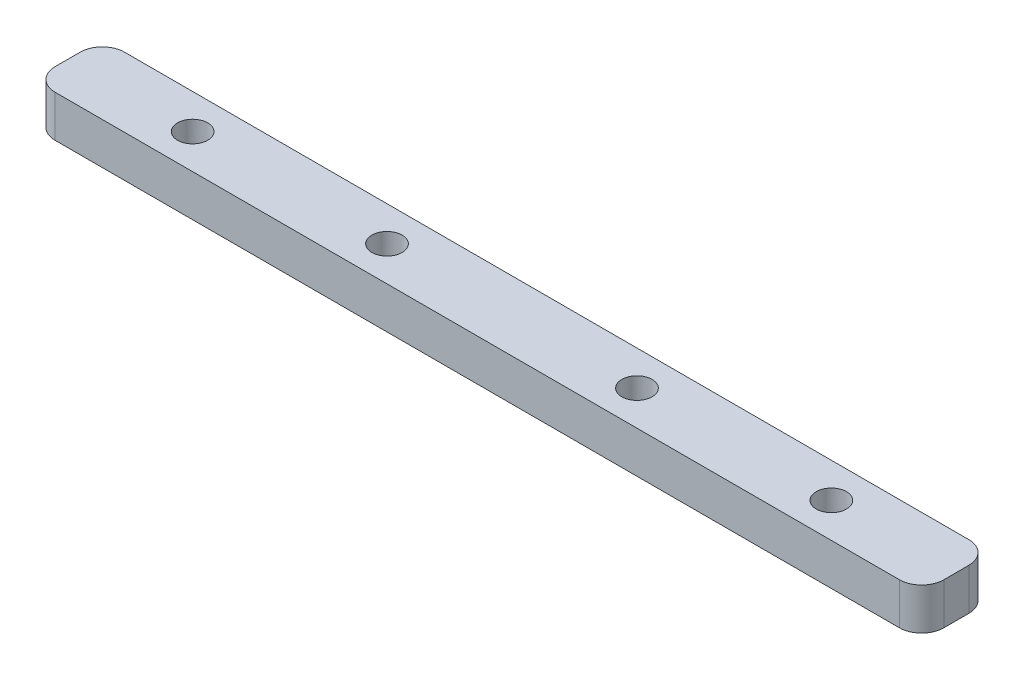
ISO-10303-21;
HEADER;
FILE_DESCRIPTION(('STEP AP214'),'2;1');
FILE_NAME('part.step','',(''),(''),'','','');
FILE_SCHEMA(('AUTOMOTIVE_DESIGN { 1 0 10303 214 1 1 1 1 }'));
ENDSEC;
DATA;
#1=APPLICATION_CONTEXT('core data for automotive mechanical design processes');
#2=APPLICATION_PROTOCOL_DEFINITION('international standard','automotive_design',2000,#1);
#3=PRODUCT_CONTEXT('',#1,'mechanical');
#4=PRODUCT('Part','Part','',(#3));
#5=PRODUCT_RELATED_PRODUCT_CATEGORY('part','',(#4));
#6=PRODUCT_DEFINITION_FORMATION('','',#4);
#7=PRODUCT_DEFINITION_CONTEXT('part definition',#1,'design');
#8=PRODUCT_DEFINITION('design','',#6,#7);
#9=PRODUCT_DEFINITION_SHAPE('','',#8);
#10=(LENGTH_UNIT() NAMED_UNIT(*) SI_UNIT(.MILLI.,.METRE.));
#11=(NAMED_UNIT(*) PLANE_ANGLE_UNIT() SI_UNIT($,.RADIAN.));
#12=(NAMED_UNIT(*) SI_UNIT($,.STERADIAN.) SOLID_ANGLE_UNIT());
#13=UNCERTAINTY_MEASURE_WITH_UNIT(LENGTH_MEASURE(1.E-05),#10,'distance_accuracy_value','');
#14=(GEOMETRIC_REPRESENTATION_CONTEXT(3) GLOBAL_UNCERTAINTY_ASSIGNED_CONTEXT((#13)) GLOBAL_UNIT_ASSIGNED_CONTEXT((#10,
#11,#12)) REPRESENTATION_CONTEXT('',''));
#15=CARTESIAN_POINT('',(0.,0.,0.));
#16=DIRECTION('',(0.,0.,1.));
#17=DIRECTION('',(1.,0.,0.));
#18=AXIS2_PLACEMENT_3D('',#15,#16,#17);
#19=CARTESIAN_POINT('',(-50.8,101.909586920221,39.1889208080387));
#20=DIRECTION('',(0.,0.,1.));
#21=DIRECTION('',(0.,-1.,0.));
#22=AXIS2_PLACEMENT_3D('',#19,#20,#21);
#23=PLANE('',#22);
#24=DIRECTION('',(-1.,0.,0.));
#25=VECTOR('',#24,1.);
#26=CARTESIAN_POINT('',(-50.8,-4.76250000012575,39.1889208080386));
#27=LINE('',#26,#25);
#28=CARTESIAN_POINT('',(48.26,-4.76250000012575,39.1889208080386));
#29=VERTEX_POINT('',#28);
#30=CARTESIAN_POINT('',(-48.26,-4.76250000012575,39.1889208080386));
#31=VERTEX_POINT('',#30);
#32=EDGE_CURVE('E133',#29,#31,#27,.T.);
#33=ORIENTED_EDGE('',*,*,#32,.T.);
#34=DIRECTION('',(0.,-1.,0.));
#35=VECTOR('',#34,1.);
#36=CARTESIAN_POINT('',(-48.26,101.909586920221,39.1889208080387));
#37=LINE('',#36,#35);
#38=CARTESIAN_POINT('',(-48.26,0.,39.1889208080386));
#39=VERTEX_POINT('',#38);
#40=EDGE_CURVE('E144',#31,#39,#37,.F.);
#41=ORIENTED_EDGE('',*,*,#40,.T.);
#42=DIRECTION('',(-1.,0.,0.));
#43=VECTOR('',#42,1.);
#44=CARTESIAN_POINT('',(-50.8,0.,39.1889208080386));
#45=LINE('',#44,#43);
#46=CARTESIAN_POINT('',(48.26,0.,39.1889208080386));
#47=VERTEX_POINT('',#46);
#48=EDGE_CURVE('E109',#47,#39,#45,.T.);
#49=ORIENTED_EDGE('',*,*,#48,.F.);
#50=DIRECTION('',(0.,-1.,0.));
#51=VECTOR('',#50,1.);
#52=CARTESIAN_POINT('',(48.26,101.909586920221,39.1889208080387));
#53=LINE('',#52,#51);
#54=EDGE_CURVE('E141',#47,#29,#53,.T.);
#55=ORIENTED_EDGE('',*,*,#54,.T.);
#56=EDGE_LOOP('',(#33,#41,#49,#55));
#57=FACE_BOUND('',#56,.T.);
#58=ADVANCED_FACE('F37',(#57),#23,.F.);
#59=CARTESIAN_POINT('',(50.8,101.909586920221,39.1889208080387));
#60=DIRECTION('',(-1.,0.,0.));
#61=DIRECTION('',(0.,0.707106781186548,0.707106781186547));
#62=AXIS2_PLACEMENT_3D('',#59,#60,#61);
#63=PLANE('',#62);
#64=DIRECTION('',(0.,0.,-1.));
#65=VECTOR('',#64,1.);
#66=CARTESIAN_POINT('',(50.8,-4.76250000012575,39.1889208080386));
#67=LINE('',#66,#65);
#68=CARTESIAN_POINT('',(50.8,-4.76250000012575,44.5864208080386));
#69=VERTEX_POINT('',#68);
#70=CARTESIAN_POINT('',(50.8,-4.76250000012575,41.7289208080386));
#71=VERTEX_POINT('',#70);
#72=EDGE_CURVE('E157',#69,#71,#67,.T.);
#73=ORIENTED_EDGE('',*,*,#72,.T.);
#74=DIRECTION('',(0.,-1.,0.));
#75=VECTOR('',#74,1.);
#76=CARTESIAN_POINT('',(50.8,101.909586920221,41.7289208080387));
#77=LINE('',#76,#75);
#78=CARTESIAN_POINT('',(50.8,0.,41.7289208080386));
#79=VERTEX_POINT('',#78);
#80=EDGE_CURVE('E11',#71,#79,#77,.F.);
#81=ORIENTED_EDGE('',*,*,#80,.T.);
#82=DIRECTION('',(0.,0.,-1.));
#83=VECTOR('',#82,1.);
#84=CARTESIAN_POINT('',(50.8,0.,39.1889208080387));
#85=LINE('',#84,#83);
#86=CARTESIAN_POINT('',(50.8,0.,44.5864208080386));
#87=VERTEX_POINT('',#86);
#88=EDGE_CURVE('E158',#87,#79,#85,.T.);
#89=ORIENTED_EDGE('',*,*,#88,.F.);
#90=DIRECTION('',(0.,-1.,0.));
#91=VECTOR('',#90,1.);
#92=CARTESIAN_POINT('',(50.8,101.909586920221,44.5864208080387));
#93=LINE('',#92,#91);
#94=EDGE_CURVE('E45',#87,#69,#93,.T.);
#95=ORIENTED_EDGE('',*,*,#94,.T.);
#96=EDGE_LOOP('',(#73,#81,#89,#95));
#97=FACE_BOUND('',#96,.T.);
#98=ADVANCED_FACE('F156',(#97),#63,.F.);
#99=CARTESIAN_POINT('',(50.8,101.909586920221,47.1264208080387));
#100=DIRECTION('',(0.,0.,-1.));
#101=DIRECTION('',(0.,1.,0.));
#102=AXIS2_PLACEMENT_3D('',#99,#100,#101);
#103=PLANE('',#102);
#104=DIRECTION('',(1.,0.,0.));
#105=VECTOR('',#104,1.);
#106=CARTESIAN_POINT('',(50.8,0.,47.1264208080386));
#107=LINE('',#106,#105);
#108=CARTESIAN_POINT('',(-48.26,0.,47.1264208080386));
#109=VERTEX_POINT('',#108);
#110=CARTESIAN_POINT('',(48.26,0.,47.1264208080386));
#111=VERTEX_POINT('',#110);
#112=EDGE_CURVE('E125',#109,#111,#107,.T.);
#113=ORIENTED_EDGE('',*,*,#112,.F.);
#114=DIRECTION('',(0.,-1.,0.));
#115=VECTOR('',#114,1.);
#116=CARTESIAN_POINT('',(-48.26,101.909586920221,47.1264208080387));
#117=LINE('',#116,#115);
#118=CARTESIAN_POINT('',(-48.26,-4.76250000012575,47.1264208080386));
#119=VERTEX_POINT('',#118);
#120=EDGE_CURVE('E151',#109,#119,#117,.T.);
#121=ORIENTED_EDGE('',*,*,#120,.T.);
#122=DIRECTION('',(1.,0.,0.));
#123=VECTOR('',#122,1.);
#124=CARTESIAN_POINT('',(50.8,-4.76250000012575,47.1264208080386));
#125=LINE('',#124,#123);
#126=CARTESIAN_POINT('',(48.26,-4.76250000012575,47.1264208080386));
#127=VERTEX_POINT('',#126);
#128=EDGE_CURVE('E166',#119,#127,#125,.T.);
#129=ORIENTED_EDGE('',*,*,#128,.T.);
#130=DIRECTION('',(0.,-1.,0.));
#131=VECTOR('',#130,1.);
#132=CARTESIAN_POINT('',(48.26,101.909586920221,47.1264208080387));
#133=LINE('',#132,#131);
#134=EDGE_CURVE('E113',#127,#111,#133,.F.);
#135=ORIENTED_EDGE('',*,*,#134,.T.);
#136=EDGE_LOOP('',(#113,#121,#129,#135));
#137=FACE_BOUND('',#136,.T.);
#138=ADVANCED_FACE('F219',(#137),#103,.F.);
#139=CARTESIAN_POINT('',(-50.8,101.909586920221,47.1264208080387));
#140=DIRECTION('',(1.,0.,0.));
#141=DIRECTION('',(0.,-0.707106781186548,-0.707106781186547));
#142=AXIS2_PLACEMENT_3D('',#139,#140,#141);
#143=PLANE('',#142);
#144=DIRECTION('',(0.,0.,1.));
#145=VECTOR('',#144,1.);
#146=CARTESIAN_POINT('',(-50.8,0.,47.1264208080387));
#147=LINE('',#146,#145);
#148=CARTESIAN_POINT('',(-50.8,0.,41.7289208080386));
#149=VERTEX_POINT('',#148);
#150=CARTESIAN_POINT('',(-50.8,0.,44.5864208080386));
#151=VERTEX_POINT('',#150);
#152=EDGE_CURVE('E106',#149,#151,#147,.T.);
#153=ORIENTED_EDGE('',*,*,#152,.F.);
#154=DIRECTION('',(0.,-1.,0.));
#155=VECTOR('',#154,1.);
#156=CARTESIAN_POINT('',(-50.8,101.909586920221,41.7289208080387));
#157=LINE('',#156,#155);
#158=CARTESIAN_POINT('',(-50.8,-4.76250000012575,41.7289208080386));
#159=VERTEX_POINT('',#158);
#160=EDGE_CURVE('E120',#149,#159,#157,.T.);
#161=ORIENTED_EDGE('',*,*,#160,.T.);
#162=DIRECTION('',(0.,0.,1.));
#163=VECTOR('',#162,1.);
#164=CARTESIAN_POINT('',(-50.8,-4.76250000012575,47.1264208080386));
#165=LINE('',#164,#163);
#166=CARTESIAN_POINT('',(-50.8,-4.76250000012574,44.5864208080386));
#167=VERTEX_POINT('',#166);
#168=EDGE_CURVE('E124',#159,#167,#165,.T.);
#169=ORIENTED_EDGE('',*,*,#168,.T.);
#170=DIRECTION('',(0.,-1.,0.));
#171=VECTOR('',#170,1.);
#172=CARTESIAN_POINT('',(-50.8,101.909586920221,44.5864208080387));
#173=LINE('',#172,#171);
#174=EDGE_CURVE('E123',#167,#151,#173,.F.);
#175=ORIENTED_EDGE('',*,*,#174,.T.);
#176=EDGE_LOOP('',(#153,#161,#169,#175));
#177=FACE_BOUND('',#176,.T.);
#178=ADVANCED_FACE('F118',(#177),#143,.F.);
#179=CARTESIAN_POINT('',(0.,-4.76250000012574,27.2737941572919));
#180=DIRECTION('',(0.,-1.,0.));
#181=DIRECTION('',(0.,0.,-1.));
#182=AXIS2_PLACEMENT_3D('',#179,#180,#181);
#183=PLANE('',#182);
#184=ORIENTED_EDGE('',*,*,#168,.F.);
#185=CARTESIAN_POINT('',(-48.26,-4.76250000012575,41.7289208080386));
#186=DIRECTION('',(0.,-1.,0.));
#187=DIRECTION('',(0.,0.,-1.));
#188=AXIS2_PLACEMENT_3D('',#185,#186,#187);
#189=CIRCLE('',#188,2.54);
#190=EDGE_CURVE('E128',#159,#31,#189,.T.);
#191=ORIENTED_EDGE('',*,*,#190,.T.);
#192=ORIENTED_EDGE('',*,*,#32,.F.);
#193=CARTESIAN_POINT('',(48.26,-4.76250000012575,41.7289208080386));
#194=DIRECTION('',(0.,-1.,0.));
#195=DIRECTION('',(0.,0.,-1.));
#196=AXIS2_PLACEMENT_3D('',#193,#194,#195);
#197=CIRCLE('',#196,2.54);
#198=EDGE_CURVE('E131',#29,#71,#197,.T.);
#199=ORIENTED_EDGE('',*,*,#198,.T.);
#200=ORIENTED_EDGE('',*,*,#72,.F.);
#201=CARTESIAN_POINT('',(48.26,-4.76250000012576,44.5864208080386));
#202=DIRECTION('',(0.,-1.,0.));
#203=DIRECTION('',(0.,0.,-1.));
#204=AXIS2_PLACEMENT_3D('',#201,#202,#203);
#205=CIRCLE('',#204,2.54);
#206=EDGE_CURVE('E129',#69,#127,#205,.T.);
#207=ORIENTED_EDGE('',*,*,#206,.T.);
#208=ORIENTED_EDGE('',*,*,#128,.F.);
#209=CARTESIAN_POINT('',(-48.26,-4.76250000012576,44.5864208080386));
#210=DIRECTION('',(0.,-1.,0.));
#211=DIRECTION('',(0.,0.,-1.));
#212=AXIS2_PLACEMENT_3D('',#209,#210,#211);
#213=CIRCLE('',#212,2.54);
#214=EDGE_CURVE('E138',#119,#167,#213,.T.);
#215=ORIENTED_EDGE('',*,*,#214,.T.);
#216=EDGE_LOOP('',(#184,#191,#192,#199,#200,#207,#208,#215));
#217=FACE_BOUND('',#216,.T.);
#218=CARTESIAN_POINT('',(36.5125,-4.76250000012574,43.1576708080247));
#219=DIRECTION('',(0.,-1.,0.));
#220=DIRECTION('',(0.,0.,-1.));
#221=AXIS2_PLACEMENT_3D('',#218,#219,#220);
#222=CIRCLE('',#221,1.7272);
#223=CARTESIAN_POINT('',(36.5125,-4.76250000012574,41.4304708080247));
#224=VERTEX_POINT('',#223);
#225=EDGE_CURVE('E175',#224,#224,#222,.F.);
#226=ORIENTED_EDGE('',*,*,#225,.T.);
#227=EDGE_LOOP('',(#226));
#228=FACE_BOUND('',#227,.T.);
#229=CARTESIAN_POINT('',(14.2875,-4.76250000012574,43.1576708080247));
#230=DIRECTION('',(0.,-1.,0.));
#231=DIRECTION('',(0.,0.,-1.));
#232=AXIS2_PLACEMENT_3D('',#229,#230,#231);
#233=CIRCLE('',#232,1.7272);
#234=CARTESIAN_POINT('',(14.2875,-4.76250000012574,41.4304708080247));
#235=VERTEX_POINT('',#234);
#236=EDGE_CURVE('E181',#235,#235,#233,.F.);
#237=ORIENTED_EDGE('',*,*,#236,.T.);
#238=EDGE_LOOP('',(#237));
#239=FACE_BOUND('',#238,.T.);
#240=CARTESIAN_POINT('',(-14.2875,-4.76250000012574,43.1576708080247));
#241=DIRECTION('',(0.,-1.,0.));
#242=DIRECTION('',(0.,0.,-1.));
#243=AXIS2_PLACEMENT_3D('',#240,#241,#242);
#244=CIRCLE('',#243,1.7272);
#245=CARTESIAN_POINT('',(-14.2875,-4.76250000012574,41.4304708080247));
#246=VERTEX_POINT('',#245);
#247=EDGE_CURVE('E187',#246,#246,#244,.F.);
#248=ORIENTED_EDGE('',*,*,#247,.T.);
#249=EDGE_LOOP('',(#248));
#250=FACE_BOUND('',#249,.T.);
#251=CARTESIAN_POINT('',(-36.5125,-4.76250000012574,43.1576708080247));
#252=DIRECTION('',(0.,-1.,0.));
#253=DIRECTION('',(0.,0.,-1.));
#254=AXIS2_PLACEMENT_3D('',#251,#252,#253);
#255=CIRCLE('',#254,1.7272);
#256=CARTESIAN_POINT('',(-36.5125,-4.76250000012574,41.4304708080247));
#257=VERTEX_POINT('',#256);
#258=EDGE_CURVE('E193',#257,#257,#255,.F.);
#259=ORIENTED_EDGE('',*,*,#258,.T.);
#260=EDGE_LOOP('',(#259));
#261=FACE_BOUND('',#260,.T.);
#262=ADVANCED_FACE('F161',(#217,#228,#239,#250,#261),#183,.T.);
#263=CARTESIAN_POINT('',(-106.090128060535,0.,39.1889208080386));
#264=DIRECTION('',(0.,1.,0.));
#265=DIRECTION('',(0.,0.,1.));
#266=AXIS2_PLACEMENT_3D('',#263,#264,#265);
#267=PLANE('',#266);
#268=ORIENTED_EDGE('',*,*,#48,.T.);
#269=CARTESIAN_POINT('',(-48.26,0.,41.7289208080386));
#270=DIRECTION('',(0.,1.,0.));
#271=DIRECTION('',(0.,0.,1.));
#272=AXIS2_PLACEMENT_3D('',#269,#270,#271);
#273=CIRCLE('',#272,2.54);
#274=EDGE_CURVE('E102',#39,#149,#273,.T.);
#275=ORIENTED_EDGE('',*,*,#274,.T.);
#276=ORIENTED_EDGE('',*,*,#152,.T.);
#277=CARTESIAN_POINT('',(-48.26,0.,44.5864208080386));
#278=DIRECTION('',(0.,1.,0.));
#279=DIRECTION('',(0.,0.,1.));
#280=AXIS2_PLACEMENT_3D('',#277,#278,#279);
#281=CIRCLE('',#280,2.54);
#282=EDGE_CURVE('E114',#151,#109,#281,.T.);
#283=ORIENTED_EDGE('',*,*,#282,.T.);
#284=ORIENTED_EDGE('',*,*,#112,.T.);
#285=CARTESIAN_POINT('',(48.26,0.,44.5864208080386));
#286=DIRECTION('',(0.,1.,0.));
#287=DIRECTION('',(0.,0.,1.));
#288=AXIS2_PLACEMENT_3D('',#285,#286,#287);
#289=CIRCLE('',#288,2.54);
#290=EDGE_CURVE('E57',#111,#87,#289,.T.);
#291=ORIENTED_EDGE('',*,*,#290,.T.);
#292=ORIENTED_EDGE('',*,*,#88,.T.);
#293=CARTESIAN_POINT('',(48.26,0.,41.7289208080386));
#294=DIRECTION('',(0.,1.,0.));
#295=DIRECTION('',(0.,0.,1.));
#296=AXIS2_PLACEMENT_3D('',#293,#294,#295);
#297=CIRCLE('',#296,2.54);
#298=EDGE_CURVE('E147',#79,#47,#297,.T.);
#299=ORIENTED_EDGE('',*,*,#298,.T.);
#300=EDGE_LOOP('',(#268,#275,#276,#283,#284,#291,#292,#299));
#301=FACE_BOUND('',#300,.T.);
#302=CARTESIAN_POINT('',(36.5125,0.,43.1576708080247));
#303=DIRECTION('',(0.,1.,0.));
#304=DIRECTION('',(0.,0.,1.));
#305=AXIS2_PLACEMENT_3D('',#302,#303,#304);
#306=CIRCLE('',#305,1.7272);
#307=CARTESIAN_POINT('',(36.5125,0.,44.8848708080248));
#308=VERTEX_POINT('',#307);
#309=EDGE_CURVE('E178',#308,#308,#306,.T.);
#310=ORIENTED_EDGE('',*,*,#309,.F.);
#311=EDGE_LOOP('',(#310));
#312=FACE_BOUND('',#311,.T.);
#313=CARTESIAN_POINT('',(14.2875,0.,43.1576708080247));
#314=DIRECTION('',(0.,1.,0.));
#315=DIRECTION('',(0.,0.,1.));
#316=AXIS2_PLACEMENT_3D('',#313,#314,#315);
#317=CIRCLE('',#316,1.7272);
#318=CARTESIAN_POINT('',(14.2875,0.,44.8848708080248));
#319=VERTEX_POINT('',#318);
#320=EDGE_CURVE('E184',#319,#319,#317,.T.);
#321=ORIENTED_EDGE('',*,*,#320,.F.);
#322=EDGE_LOOP('',(#321));
#323=FACE_BOUND('',#322,.T.);
#324=CARTESIAN_POINT('',(-14.2875,0.,43.1576708080247));
#325=DIRECTION('',(0.,1.,0.));
#326=DIRECTION('',(0.,0.,1.));
#327=AXIS2_PLACEMENT_3D('',#324,#325,#326);
#328=CIRCLE('',#327,1.7272);
#329=CARTESIAN_POINT('',(-14.2875,0.,44.8848708080248));
#330=VERTEX_POINT('',#329);
#331=EDGE_CURVE('E190',#330,#330,#328,.T.);
#332=ORIENTED_EDGE('',*,*,#331,.F.);
#333=EDGE_LOOP('',(#332));
#334=FACE_BOUND('',#333,.T.);
#335=CARTESIAN_POINT('',(-36.5125,0.,43.1576708080247));
#336=DIRECTION('',(0.,1.,0.));
#337=DIRECTION('',(0.,0.,1.));
#338=AXIS2_PLACEMENT_3D('',#335,#336,#337);
#339=CIRCLE('',#338,1.7272);
#340=CARTESIAN_POINT('',(-36.5125,0.,44.8848708080248));
#341=VERTEX_POINT('',#340);
#342=EDGE_CURVE('E196',#341,#341,#339,.T.);
#343=ORIENTED_EDGE('',*,*,#342,.F.);
#344=EDGE_LOOP('',(#343));
#345=FACE_BOUND('',#344,.T.);
#346=ADVANCED_FACE('F104',(#301,#312,#323,#334,#345),#267,.T.);
#347=CARTESIAN_POINT('',(-48.26,101.909586920221,41.7289208080387));
#348=DIRECTION('',(0.,-1.,0.));
#349=DIRECTION('',(0.,0.,-1.));
#350=AXIS2_PLACEMENT_3D('',#347,#348,#349);
#351=CYLINDRICAL_SURFACE('',#350,2.54);
#352=ORIENTED_EDGE('',*,*,#274,.F.);
#353=ORIENTED_EDGE('',*,*,#40,.F.);
#354=ORIENTED_EDGE('',*,*,#190,.F.);
#355=ORIENTED_EDGE('',*,*,#160,.F.);
#356=EDGE_LOOP('',(#352,#353,#354,#355));
#357=FACE_BOUND('',#356,.T.);
#358=ADVANCED_FACE('F127',(#357),#351,.T.);
#359=CARTESIAN_POINT('',(-48.26,101.909586920221,44.5864208080387));
#360=DIRECTION('',(0.,-1.,0.));
#361=DIRECTION('',(0.,0.,-1.));
#362=AXIS2_PLACEMENT_3D('',#359,#360,#361);
#363=CYLINDRICAL_SURFACE('',#362,2.54);
#364=ORIENTED_EDGE('',*,*,#282,.F.);
#365=ORIENTED_EDGE('',*,*,#174,.F.);
#366=ORIENTED_EDGE('',*,*,#214,.F.);
#367=ORIENTED_EDGE('',*,*,#120,.F.);
#368=EDGE_LOOP('',(#364,#365,#366,#367));
#369=FACE_BOUND('',#368,.T.);
#370=ADVANCED_FACE('F209',(#369),#363,.T.);
#371=CARTESIAN_POINT('',(48.26,101.909586920221,41.7289208080387));
#372=DIRECTION('',(0.,-1.,0.));
#373=DIRECTION('',(0.,0.,-1.));
#374=AXIS2_PLACEMENT_3D('',#371,#372,#373);
#375=CYLINDRICAL_SURFACE('',#374,2.54);
#376=ORIENTED_EDGE('',*,*,#298,.F.);
#377=ORIENTED_EDGE('',*,*,#80,.F.);
#378=ORIENTED_EDGE('',*,*,#198,.F.);
#379=ORIENTED_EDGE('',*,*,#54,.F.);
#380=EDGE_LOOP('',(#376,#377,#378,#379));
#381=FACE_BOUND('',#380,.T.);
#382=ADVANCED_FACE('F228',(#381),#375,.T.);
#383=CARTESIAN_POINT('',(48.26,101.909586920221,44.5864208080387));
#384=DIRECTION('',(0.,-1.,0.));
#385=DIRECTION('',(0.,0.,-1.));
#386=AXIS2_PLACEMENT_3D('',#383,#384,#385);
#387=CYLINDRICAL_SURFACE('',#386,2.54);
#388=ORIENTED_EDGE('',*,*,#290,.F.);
#389=ORIENTED_EDGE('',*,*,#134,.F.);
#390=ORIENTED_EDGE('',*,*,#206,.F.);
#391=ORIENTED_EDGE('',*,*,#94,.F.);
#392=EDGE_LOOP('',(#388,#389,#390,#391));
#393=FACE_BOUND('',#392,.T.);
#394=ADVANCED_FACE('F39',(#393),#387,.T.);
#395=CARTESIAN_POINT('',(36.5125,-10.1326931605251,43.1576708080247));
#396=DIRECTION('',(0.,1.,0.));
#397=DIRECTION('',(0.,0.,1.));
#398=AXIS2_PLACEMENT_3D('',#395,#396,#397);
#399=CYLINDRICAL_SURFACE('',#398,1.7272);
#400=ORIENTED_EDGE('',*,*,#309,.T.);
#401=EDGE_LOOP('',(#400));
#402=FACE_BOUND('',#401,.T.);
#403=ORIENTED_EDGE('',*,*,#225,.F.);
#404=EDGE_LOOP('',(#403));
#405=FACE_BOUND('',#404,.T.);
#406=ADVANCED_FACE('F235',(#402,#405),#399,.F.);
#407=CARTESIAN_POINT('',(14.2875,-10.1326931605251,43.1576708080247));
#408=DIRECTION('',(0.,1.,0.));
#409=DIRECTION('',(0.,0.,1.));
#410=AXIS2_PLACEMENT_3D('',#407,#408,#409);
#411=CYLINDRICAL_SURFACE('',#410,1.7272);
#412=ORIENTED_EDGE('',*,*,#320,.T.);
#413=EDGE_LOOP('',(#412));
#414=FACE_BOUND('',#413,.T.);
#415=ORIENTED_EDGE('',*,*,#236,.F.);
#416=EDGE_LOOP('',(#415));
#417=FACE_BOUND('',#416,.T.);
#418=ADVANCED_FACE('F244',(#414,#417),#411,.F.);
#419=CARTESIAN_POINT('',(-14.2875,-10.1326931605251,43.1576708080247));
#420=DIRECTION('',(0.,1.,0.));
#421=DIRECTION('',(0.,0.,1.));
#422=AXIS2_PLACEMENT_3D('',#419,#420,#421);
#423=CYLINDRICAL_SURFACE('',#422,1.7272);
#424=ORIENTED_EDGE('',*,*,#331,.T.);
#425=EDGE_LOOP('',(#424));
#426=FACE_BOUND('',#425,.T.);
#427=ORIENTED_EDGE('',*,*,#247,.F.);
#428=EDGE_LOOP('',(#427));
#429=FACE_BOUND('',#428,.T.);
#430=ADVANCED_FACE('F249',(#426,#429),#423,.F.);
#431=CARTESIAN_POINT('',(-36.5125,-10.1326931605251,43.1576708080247));
#432=DIRECTION('',(0.,1.,0.));
#433=DIRECTION('',(0.,0.,1.));
#434=AXIS2_PLACEMENT_3D('',#431,#432,#433);
#435=CYLINDRICAL_SURFACE('',#434,1.7272);
#436=ORIENTED_EDGE('',*,*,#342,.T.);
#437=EDGE_LOOP('',(#436));
#438=FACE_BOUND('',#437,.T.);
#439=ORIENTED_EDGE('',*,*,#258,.F.);
#440=EDGE_LOOP('',(#439));
#441=FACE_BOUND('',#440,.T.);
#442=ADVANCED_FACE('F200',(#438,#441),#435,.F.);
#443=CLOSED_SHELL('',(#58,#98,#138,#178,#262,#346,#358,#370,#382,#394,#406,#418,#430,#442));
#444=MANIFOLD_SOLID_BREP('B2',#443);
#445=ADVANCED_BREP_SHAPE_REPRESENTATION('',(#18,#444),#14);
#446=SHAPE_DEFINITION_REPRESENTATION(#9,#445);
ENDSEC;
END-ISO-10303-21;
